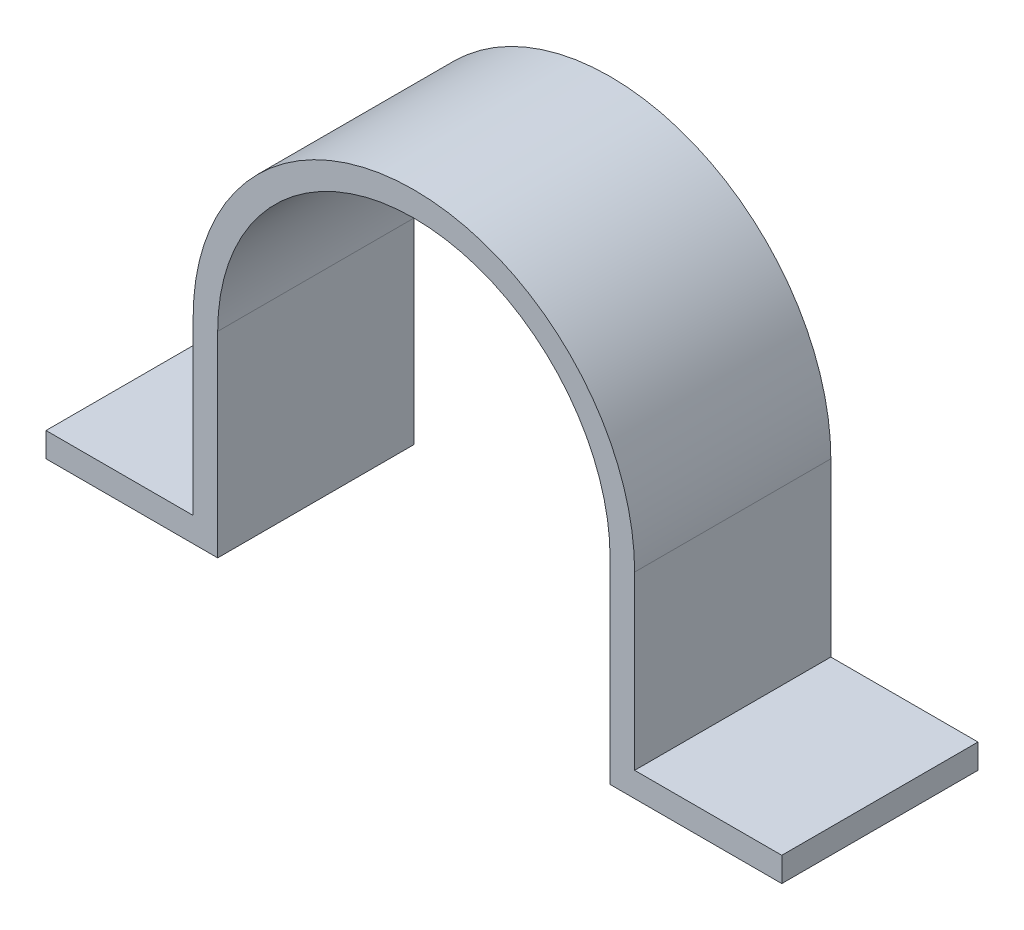
ISO-10303-21;
HEADER;
FILE_DESCRIPTION(('STEP AP214'),'2;1');
FILE_NAME('part.step','',(''),(''),'','','');
FILE_SCHEMA(('AUTOMOTIVE_DESIGN { 1 0 10303 214 1 1 1 1 }'));
ENDSEC;
DATA;
#1=APPLICATION_CONTEXT('core data for automotive mechanical design processes');
#2=APPLICATION_PROTOCOL_DEFINITION('international standard','automotive_design',2000,#1);
#3=PRODUCT_CONTEXT('',#1,'mechanical');
#4=PRODUCT('Part','Part','',(#3));
#5=PRODUCT_RELATED_PRODUCT_CATEGORY('part','',(#4));
#6=PRODUCT_DEFINITION_FORMATION('','',#4);
#7=PRODUCT_DEFINITION_CONTEXT('part definition',#1,'design');
#8=PRODUCT_DEFINITION('design','',#6,#7);
#9=PRODUCT_DEFINITION_SHAPE('','',#8);
#10=(LENGTH_UNIT() NAMED_UNIT(*) SI_UNIT(.MILLI.,.METRE.));
#11=(NAMED_UNIT(*) PLANE_ANGLE_UNIT() SI_UNIT($,.RADIAN.));
#12=(NAMED_UNIT(*) SI_UNIT($,.STERADIAN.) SOLID_ANGLE_UNIT());
#13=UNCERTAINTY_MEASURE_WITH_UNIT(LENGTH_MEASURE(1.E-05),#10,'distance_accuracy_value','');
#14=(GEOMETRIC_REPRESENTATION_CONTEXT(3) GLOBAL_UNCERTAINTY_ASSIGNED_CONTEXT((#13)) GLOBAL_UNIT_ASSIGNED_CONTEXT((#10,
#11,#12)) REPRESENTATION_CONTEXT('',''));
#15=CARTESIAN_POINT('',(0.,0.,0.));
#16=DIRECTION('',(0.,0.,1.));
#17=DIRECTION('',(1.,0.,0.));
#18=AXIS2_PLACEMENT_3D('',#15,#16,#17);
#19=CARTESIAN_POINT('',(-47.625,-25.4,0.));
#20=DIRECTION('',(0.,-1.,0.));
#21=DIRECTION('',(0.,0.,-1.));
#22=AXIS2_PLACEMENT_3D('',#19,#20,#21);
#23=PLANE('',#22);
#24=DIRECTION('',(1.,0.,0.));
#25=VECTOR('',#24,1.);
#26=CARTESIAN_POINT('',(0.,-25.4,25.4));
#27=LINE('',#26,#25);
#28=CARTESIAN_POINT('',(-47.625,-25.4,25.4));
#29=VERTEX_POINT('',#28);
#30=CARTESIAN_POINT('',(-25.4,-25.4,25.4));
#31=VERTEX_POINT('',#30);
#32=EDGE_CURVE('E79',#29,#31,#27,.T.);
#33=ORIENTED_EDGE('',*,*,#32,.F.);
#34=DIRECTION('',(0.,0.,1.));
#35=VECTOR('',#34,1.);
#36=CARTESIAN_POINT('',(-47.625,-25.4,0.));
#37=LINE('',#36,#35);
#38=CARTESIAN_POINT('',(-47.625,-25.4,0.));
#39=VERTEX_POINT('',#38);
#40=EDGE_CURVE('E218',#39,#29,#37,.T.);
#41=ORIENTED_EDGE('',*,*,#40,.F.);
#42=DIRECTION('',(1.,0.,0.));
#43=VECTOR('',#42,1.);
#44=CARTESIAN_POINT('',(0.,-25.4,0.));
#45=LINE('',#44,#43);
#46=CARTESIAN_POINT('',(-25.4,-25.4,0.));
#47=VERTEX_POINT('',#46);
#48=EDGE_CURVE('E136',#39,#47,#45,.T.);
#49=ORIENTED_EDGE('',*,*,#48,.T.);
#50=DIRECTION('',(0.,0.,1.));
#51=VECTOR('',#50,1.);
#52=CARTESIAN_POINT('',(-25.4,-25.4,0.));
#53=LINE('',#52,#51);
#54=EDGE_CURVE('E68',#31,#47,#53,.F.);
#55=ORIENTED_EDGE('',*,*,#54,.F.);
#56=EDGE_LOOP('',(#33,#41,#49,#55));
#57=FACE_BOUND('',#56,.T.);
#58=ADVANCED_FACE('F17',(#57),#23,.T.);
#59=CARTESIAN_POINT('',(-25.4,-25.4,0.));
#60=DIRECTION('',(1.,0.,0.));
#61=DIRECTION('',(0.,1.,0.));
#62=AXIS2_PLACEMENT_3D('',#59,#60,#61);
#63=PLANE('',#62);
#64=DIRECTION('',(0.,1.,0.));
#65=VECTOR('',#64,1.);
#66=CARTESIAN_POINT('',(-25.4,-3.44837810483188,25.4));
#67=LINE('',#66,#65);
#68=CARTESIAN_POINT('',(-25.4,0.,25.4));
#69=VERTEX_POINT('',#68);
#70=EDGE_CURVE('E151',#31,#69,#67,.T.);
#71=ORIENTED_EDGE('',*,*,#70,.F.);
#72=ORIENTED_EDGE('',*,*,#54,.T.);
#73=DIRECTION('',(0.,1.,0.));
#74=VECTOR('',#73,1.);
#75=CARTESIAN_POINT('',(-25.4,-3.44837810483188,0.));
#76=LINE('',#75,#74);
#77=CARTESIAN_POINT('',(-25.4,0.,0.));
#78=VERTEX_POINT('',#77);
#79=EDGE_CURVE('E61',#47,#78,#76,.T.);
#80=ORIENTED_EDGE('',*,*,#79,.T.);
#81=DIRECTION('',(0.,0.,1.));
#82=VECTOR('',#81,1.);
#83=CARTESIAN_POINT('',(-25.4,0.,0.));
#84=LINE('',#83,#82);
#85=EDGE_CURVE('E227',#78,#69,#84,.T.);
#86=ORIENTED_EDGE('',*,*,#85,.T.);
#87=EDGE_LOOP('',(#71,#72,#80,#86));
#88=FACE_BOUND('',#87,.T.);
#89=ADVANCED_FACE('F258',(#88),#63,.T.);
#90=CARTESIAN_POINT('',(0.,0.,0.));
#91=DIRECTION('',(0.,0.,1.));
#92=DIRECTION('',(1.,0.,0.));
#93=AXIS2_PLACEMENT_3D('',#90,#91,#92);
#94=CYLINDRICAL_SURFACE('',#93,25.4);
#95=DIRECTION('',(0.,0.,1.));
#96=VECTOR('',#95,1.);
#97=CARTESIAN_POINT('',(25.4,0.,0.));
#98=LINE('',#97,#96);
#99=CARTESIAN_POINT('',(25.4,0.,25.4));
#100=VERTEX_POINT('',#99);
#101=CARTESIAN_POINT('',(25.4,0.,0.));
#102=VERTEX_POINT('',#101);
#103=EDGE_CURVE('E108',#100,#102,#98,.F.);
#104=ORIENTED_EDGE('',*,*,#103,.F.);
#105=CARTESIAN_POINT('',(0.,0.,25.4));
#106=DIRECTION('',(0.,0.,1.));
#107=DIRECTION('',(1.,0.,0.));
#108=AXIS2_PLACEMENT_3D('',#105,#106,#107);
#109=CIRCLE('',#108,25.4);
#110=EDGE_CURVE('E148',#69,#100,#109,.F.);
#111=ORIENTED_EDGE('',*,*,#110,.F.);
#112=ORIENTED_EDGE('',*,*,#85,.F.);
#113=CARTESIAN_POINT('',(0.,0.,0.));
#114=DIRECTION('',(0.,0.,1.));
#115=DIRECTION('',(1.,0.,0.));
#116=AXIS2_PLACEMENT_3D('',#113,#114,#115);
#117=CIRCLE('',#116,25.4);
#118=EDGE_CURVE('E20',#78,#102,#117,.F.);
#119=ORIENTED_EDGE('',*,*,#118,.T.);
#120=EDGE_LOOP('',(#104,#111,#112,#119));
#121=FACE_BOUND('',#120,.T.);
#122=ADVANCED_FACE('F263',(#121),#94,.F.);
#123=CARTESIAN_POINT('',(25.4,0.,0.));
#124=DIRECTION('',(-1.,0.,0.));
#125=DIRECTION('',(0.,0.,1.));
#126=AXIS2_PLACEMENT_3D('',#123,#124,#125);
#127=PLANE('',#126);
#128=DIRECTION('',(0.,1.,0.));
#129=VECTOR('',#128,1.);
#130=CARTESIAN_POINT('',(25.4,-3.44837810483188,25.4));
#131=LINE('',#130,#129);
#132=CARTESIAN_POINT('',(25.4,-25.4,25.4));
#133=VERTEX_POINT('',#132);
#134=EDGE_CURVE('E150',#100,#133,#131,.F.);
#135=ORIENTED_EDGE('',*,*,#134,.F.);
#136=ORIENTED_EDGE('',*,*,#103,.T.);
#137=DIRECTION('',(0.,1.,0.));
#138=VECTOR('',#137,1.);
#139=CARTESIAN_POINT('',(25.4,-3.44837810483188,0.));
#140=LINE('',#139,#138);
#141=CARTESIAN_POINT('',(25.4,-25.4,0.));
#142=VERTEX_POINT('',#141);
#143=EDGE_CURVE('E102',#102,#142,#140,.F.);
#144=ORIENTED_EDGE('',*,*,#143,.T.);
#145=DIRECTION('',(0.,0.,-1.));
#146=VECTOR('',#145,1.);
#147=CARTESIAN_POINT('',(25.4,-25.4,0.));
#148=LINE('',#147,#146);
#149=EDGE_CURVE('E106',#133,#142,#148,.T.);
#150=ORIENTED_EDGE('',*,*,#149,.F.);
#151=EDGE_LOOP('',(#135,#136,#144,#150));
#152=FACE_BOUND('',#151,.T.);
#153=ADVANCED_FACE('F105',(#152),#127,.T.);
#154=CARTESIAN_POINT('',(25.4,-25.4,0.));
#155=DIRECTION('',(0.,-1.,0.));
#156=DIRECTION('',(0.,0.,-1.));
#157=AXIS2_PLACEMENT_3D('',#154,#155,#156);
#158=PLANE('',#157);
#159=DIRECTION('',(1.,0.,0.));
#160=VECTOR('',#159,1.);
#161=CARTESIAN_POINT('',(0.,-25.4,25.4));
#162=LINE('',#161,#160);
#163=CARTESIAN_POINT('',(47.625,-25.4,25.4));
#164=VERTEX_POINT('',#163);
#165=EDGE_CURVE('E118',#133,#164,#162,.T.);
#166=ORIENTED_EDGE('',*,*,#165,.F.);
#167=ORIENTED_EDGE('',*,*,#149,.T.);
#168=DIRECTION('',(1.,0.,0.));
#169=VECTOR('',#168,1.);
#170=CARTESIAN_POINT('',(0.,-25.4,0.));
#171=LINE('',#170,#169);
#172=CARTESIAN_POINT('',(47.625,-25.4,0.));
#173=VERTEX_POINT('',#172);
#174=EDGE_CURVE('E112',#142,#173,#171,.T.);
#175=ORIENTED_EDGE('',*,*,#174,.T.);
#176=DIRECTION('',(0.,0.,-1.));
#177=VECTOR('',#176,1.);
#178=CARTESIAN_POINT('',(47.625,-25.4,0.));
#179=LINE('',#178,#177);
#180=EDGE_CURVE('E120',#164,#173,#179,.T.);
#181=ORIENTED_EDGE('',*,*,#180,.F.);
#182=EDGE_LOOP('',(#166,#167,#175,#181));
#183=FACE_BOUND('',#182,.T.);
#184=ADVANCED_FACE('F115',(#183),#158,.T.);
#185=CARTESIAN_POINT('',(47.625,-25.4,0.));
#186=DIRECTION('',(1.,0.,0.));
#187=DIRECTION('',(0.,0.,-1.));
#188=AXIS2_PLACEMENT_3D('',#185,#186,#187);
#189=PLANE('',#188);
#190=DIRECTION('',(0.,1.,0.));
#191=VECTOR('',#190,1.);
#192=CARTESIAN_POINT('',(47.625,-3.44837810483188,25.4));
#193=LINE('',#192,#191);
#194=CARTESIAN_POINT('',(47.625,-22.225,25.4));
#195=VERTEX_POINT('',#194);
#196=EDGE_CURVE('E187',#164,#195,#193,.T.);
#197=ORIENTED_EDGE('',*,*,#196,.F.);
#198=ORIENTED_EDGE('',*,*,#180,.T.);
#199=DIRECTION('',(0.,1.,0.));
#200=VECTOR('',#199,1.);
#201=CARTESIAN_POINT('',(47.625,-3.44837810483188,0.));
#202=LINE('',#201,#200);
#203=CARTESIAN_POINT('',(47.625,-22.225,0.));
#204=VERTEX_POINT('',#203);
#205=EDGE_CURVE('E127',#173,#204,#202,.T.);
#206=ORIENTED_EDGE('',*,*,#205,.T.);
#207=DIRECTION('',(0.,0.,1.));
#208=VECTOR('',#207,1.);
#209=CARTESIAN_POINT('',(47.625,-22.225,0.));
#210=LINE('',#209,#208);
#211=EDGE_CURVE('E176',#195,#204,#210,.F.);
#212=ORIENTED_EDGE('',*,*,#211,.F.);
#213=EDGE_LOOP('',(#197,#198,#206,#212));
#214=FACE_BOUND('',#213,.T.);
#215=ADVANCED_FACE('F293',(#214),#189,.T.);
#216=CARTESIAN_POINT('',(-28.575,-22.225,0.));
#217=DIRECTION('',(0.,1.,0.));
#218=DIRECTION('',(-1.,0.,0.));
#219=AXIS2_PLACEMENT_3D('',#216,#217,#218);
#220=PLANE('',#219);
#221=DIRECTION('',(1.,0.,0.));
#222=VECTOR('',#221,1.);
#223=CARTESIAN_POINT('',(0.,-22.225,25.4));
#224=LINE('',#223,#222);
#225=CARTESIAN_POINT('',(-28.575,-22.225,25.4));
#226=VERTEX_POINT('',#225);
#227=CARTESIAN_POINT('',(-47.625,-22.225,25.4));
#228=VERTEX_POINT('',#227);
#229=EDGE_CURVE('E203',#226,#228,#224,.F.);
#230=ORIENTED_EDGE('',*,*,#229,.F.);
#231=DIRECTION('',(0.,0.,1.));
#232=VECTOR('',#231,1.);
#233=CARTESIAN_POINT('',(-28.575,-22.225,0.));
#234=LINE('',#233,#232);
#235=CARTESIAN_POINT('',(-28.575,-22.225,0.));
#236=VERTEX_POINT('',#235);
#237=EDGE_CURVE('E156',#236,#226,#234,.T.);
#238=ORIENTED_EDGE('',*,*,#237,.F.);
#239=DIRECTION('',(1.,0.,0.));
#240=VECTOR('',#239,1.);
#241=CARTESIAN_POINT('',(0.,-22.225,0.));
#242=LINE('',#241,#240);
#243=CARTESIAN_POINT('',(-47.625,-22.225,0.));
#244=VERTEX_POINT('',#243);
#245=EDGE_CURVE('E196',#236,#244,#242,.F.);
#246=ORIENTED_EDGE('',*,*,#245,.T.);
#247=DIRECTION('',(0.,0.,1.));
#248=VECTOR('',#247,1.);
#249=CARTESIAN_POINT('',(-47.625,-22.225,0.));
#250=LINE('',#249,#248);
#251=EDGE_CURVE('E210',#228,#244,#250,.F.);
#252=ORIENTED_EDGE('',*,*,#251,.F.);
#253=EDGE_LOOP('',(#230,#238,#246,#252));
#254=FACE_BOUND('',#253,.T.);
#255=ADVANCED_FACE('F290',(#254),#220,.T.);
#256=CARTESIAN_POINT('',(-47.625,-22.225,0.));
#257=DIRECTION('',(-1.,0.,0.));
#258=DIRECTION('',(0.,0.,1.));
#259=AXIS2_PLACEMENT_3D('',#256,#257,#258);
#260=PLANE('',#259);
#261=DIRECTION('',(0.,1.,0.));
#262=VECTOR('',#261,1.);
#263=CARTESIAN_POINT('',(-47.625,-3.44837810483188,25.4));
#264=LINE('',#263,#262);
#265=EDGE_CURVE('E181',#228,#29,#264,.F.);
#266=ORIENTED_EDGE('',*,*,#265,.F.);
#267=ORIENTED_EDGE('',*,*,#251,.T.);
#268=DIRECTION('',(0.,1.,0.));
#269=VECTOR('',#268,1.);
#270=CARTESIAN_POINT('',(-47.625,-3.44837810483188,0.));
#271=LINE('',#270,#269);
#272=EDGE_CURVE('E139',#244,#39,#271,.F.);
#273=ORIENTED_EDGE('',*,*,#272,.T.);
#274=ORIENTED_EDGE('',*,*,#40,.T.);
#275=EDGE_LOOP('',(#266,#267,#273,#274));
#276=FACE_BOUND('',#275,.T.);
#277=ADVANCED_FACE('F255',(#276),#260,.T.);
#278=CARTESIAN_POINT('',(47.625,-22.225,0.));
#279=DIRECTION('',(0.,1.,0.));
#280=DIRECTION('',(0.,0.,1.));
#281=AXIS2_PLACEMENT_3D('',#278,#279,#280);
#282=PLANE('',#281);
#283=DIRECTION('',(1.,0.,0.));
#284=VECTOR('',#283,1.);
#285=CARTESIAN_POINT('',(0.,-22.225,25.4));
#286=LINE('',#285,#284);
#287=CARTESIAN_POINT('',(28.575,-22.225,25.4));
#288=VERTEX_POINT('',#287);
#289=EDGE_CURVE('E184',#195,#288,#286,.F.);
#290=ORIENTED_EDGE('',*,*,#289,.F.);
#291=ORIENTED_EDGE('',*,*,#211,.T.);
#292=DIRECTION('',(1.,0.,0.));
#293=VECTOR('',#292,1.);
#294=CARTESIAN_POINT('',(0.,-22.225,0.));
#295=LINE('',#294,#293);
#296=CARTESIAN_POINT('',(28.575,-22.225,0.));
#297=VERTEX_POINT('',#296);
#298=EDGE_CURVE('E129',#204,#297,#295,.F.);
#299=ORIENTED_EDGE('',*,*,#298,.T.);
#300=DIRECTION('',(0.,0.,-1.));
#301=VECTOR('',#300,1.);
#302=CARTESIAN_POINT('',(28.575,-22.225,0.));
#303=LINE('',#302,#301);
#304=EDGE_CURVE('E147',#288,#297,#303,.T.);
#305=ORIENTED_EDGE('',*,*,#304,.F.);
#306=EDGE_LOOP('',(#290,#291,#299,#305));
#307=FACE_BOUND('',#306,.T.);
#308=ADVANCED_FACE('F284',(#307),#282,.T.);
#309=CARTESIAN_POINT('',(0.,-3.44837810483188,0.));
#310=DIRECTION('',(0.,0.,1.));
#311=DIRECTION('',(1.,0.,0.));
#312=AXIS2_PLACEMENT_3D('',#309,#310,#311);
#313=PLANE('',#312);
#314=ORIENTED_EDGE('',*,*,#272,.F.);
#315=ORIENTED_EDGE('',*,*,#245,.F.);
#316=DIRECTION('',(0.,-1.,0.));
#317=VECTOR('',#316,1.);
#318=CARTESIAN_POINT('',(-28.575,0.,0.));
#319=LINE('',#318,#317);
#320=CARTESIAN_POINT('',(-28.575,0.,0.));
#321=VERTEX_POINT('',#320);
#322=EDGE_CURVE('E138',#321,#236,#319,.T.);
#323=ORIENTED_EDGE('',*,*,#322,.F.);
#324=CARTESIAN_POINT('',(0.,0.,0.));
#325=DIRECTION('',(0.,0.,1.));
#326=DIRECTION('',(1.,0.,0.));
#327=AXIS2_PLACEMENT_3D('',#324,#325,#326);
#328=CIRCLE('',#327,28.575);
#329=CARTESIAN_POINT('',(28.575,0.,0.));
#330=VERTEX_POINT('',#329);
#331=EDGE_CURVE('E145',#330,#321,#328,.T.);
#332=ORIENTED_EDGE('',*,*,#331,.F.);
#333=DIRECTION('',(0.,1.,0.));
#334=VECTOR('',#333,1.);
#335=CARTESIAN_POINT('',(28.575,-22.225,0.));
#336=LINE('',#335,#334);
#337=EDGE_CURVE('E166',#297,#330,#336,.T.);
#338=ORIENTED_EDGE('',*,*,#337,.F.);
#339=ORIENTED_EDGE('',*,*,#298,.F.);
#340=ORIENTED_EDGE('',*,*,#205,.F.);
#341=ORIENTED_EDGE('',*,*,#174,.F.);
#342=ORIENTED_EDGE('',*,*,#143,.F.);
#343=ORIENTED_EDGE('',*,*,#118,.F.);
#344=ORIENTED_EDGE('',*,*,#79,.F.);
#345=ORIENTED_EDGE('',*,*,#48,.F.);
#346=EDGE_LOOP('',(#314,#315,#323,#332,#338,#339,#340,#341,#342,#343,#344,#345));
#347=FACE_BOUND('',#346,.T.);
#348=ADVANCED_FACE('F124',(#347),#313,.F.);
#349=CARTESIAN_POINT('',(-28.575,0.,0.));
#350=DIRECTION('',(-1.,0.,0.));
#351=DIRECTION('',(0.,-1.,0.));
#352=AXIS2_PLACEMENT_3D('',#349,#350,#351);
#353=PLANE('',#352);
#354=DIRECTION('',(0.,1.,0.));
#355=VECTOR('',#354,1.);
#356=CARTESIAN_POINT('',(-28.575,-3.44837810483188,25.4));
#357=LINE('',#356,#355);
#358=CARTESIAN_POINT('',(-28.575,0.,25.4));
#359=VERTEX_POINT('',#358);
#360=EDGE_CURVE('E186',#359,#226,#357,.F.);
#361=ORIENTED_EDGE('',*,*,#360,.F.);
#362=DIRECTION('',(0.,0.,1.));
#363=VECTOR('',#362,1.);
#364=CARTESIAN_POINT('',(-28.575,0.,0.));
#365=LINE('',#364,#363);
#366=EDGE_CURVE('E144',#321,#359,#365,.T.);
#367=ORIENTED_EDGE('',*,*,#366,.F.);
#368=ORIENTED_EDGE('',*,*,#322,.T.);
#369=ORIENTED_EDGE('',*,*,#237,.T.);
#370=EDGE_LOOP('',(#361,#367,#368,#369));
#371=FACE_BOUND('',#370,.T.);
#372=ADVANCED_FACE('F278',(#371),#353,.T.);
#373=CARTESIAN_POINT('',(0.,-3.44837810483188,25.4));
#374=DIRECTION('',(0.,0.,1.));
#375=DIRECTION('',(1.,0.,0.));
#376=AXIS2_PLACEMENT_3D('',#373,#374,#375);
#377=PLANE('',#376);
#378=ORIENTED_EDGE('',*,*,#229,.T.);
#379=ORIENTED_EDGE('',*,*,#265,.T.);
#380=ORIENTED_EDGE('',*,*,#32,.T.);
#381=ORIENTED_EDGE('',*,*,#70,.T.);
#382=ORIENTED_EDGE('',*,*,#110,.T.);
#383=ORIENTED_EDGE('',*,*,#134,.T.);
#384=ORIENTED_EDGE('',*,*,#165,.T.);
#385=ORIENTED_EDGE('',*,*,#196,.T.);
#386=ORIENTED_EDGE('',*,*,#289,.T.);
#387=DIRECTION('',(0.,1.,0.));
#388=VECTOR('',#387,1.);
#389=CARTESIAN_POINT('',(28.575,-22.225,25.4));
#390=LINE('',#389,#388);
#391=CARTESIAN_POINT('',(28.575,0.,25.4));
#392=VERTEX_POINT('',#391);
#393=EDGE_CURVE('E35',#392,#288,#390,.F.);
#394=ORIENTED_EDGE('',*,*,#393,.F.);
#395=CARTESIAN_POINT('',(0.,0.,25.4));
#396=DIRECTION('',(0.,0.,1.));
#397=DIRECTION('',(1.,0.,0.));
#398=AXIS2_PLACEMENT_3D('',#395,#396,#397);
#399=CIRCLE('',#398,28.575);
#400=EDGE_CURVE('E26',#359,#392,#399,.F.);
#401=ORIENTED_EDGE('',*,*,#400,.F.);
#402=ORIENTED_EDGE('',*,*,#360,.T.);
#403=EDGE_LOOP('',(#378,#379,#380,#381,#382,#383,#384,#385,#386,#394,#401,#402));
#404=FACE_BOUND('',#403,.T.);
#405=ADVANCED_FACE('F272',(#404),#377,.T.);
#406=CARTESIAN_POINT('',(28.575,-22.225,0.));
#407=DIRECTION('',(1.,0.,0.));
#408=DIRECTION('',(0.,0.,-1.));
#409=AXIS2_PLACEMENT_3D('',#406,#407,#408);
#410=PLANE('',#409);
#411=ORIENTED_EDGE('',*,*,#393,.T.);
#412=ORIENTED_EDGE('',*,*,#304,.T.);
#413=ORIENTED_EDGE('',*,*,#337,.T.);
#414=DIRECTION('',(0.,0.,1.));
#415=VECTOR('',#414,1.);
#416=CARTESIAN_POINT('',(28.575,0.,0.));
#417=LINE('',#416,#415);
#418=EDGE_CURVE('E11',#392,#330,#417,.F.);
#419=ORIENTED_EDGE('',*,*,#418,.F.);
#420=EDGE_LOOP('',(#411,#412,#413,#419));
#421=FACE_BOUND('',#420,.T.);
#422=ADVANCED_FACE('F266',(#421),#410,.T.);
#423=CARTESIAN_POINT('',(0.,0.,0.));
#424=DIRECTION('',(0.,0.,1.));
#425=DIRECTION('',(1.,0.,0.));
#426=AXIS2_PLACEMENT_3D('',#423,#424,#425);
#427=CYLINDRICAL_SURFACE('',#426,28.575);
#428=ORIENTED_EDGE('',*,*,#400,.T.);
#429=ORIENTED_EDGE('',*,*,#418,.T.);
#430=ORIENTED_EDGE('',*,*,#331,.T.);
#431=ORIENTED_EDGE('',*,*,#366,.T.);
#432=EDGE_LOOP('',(#428,#429,#430,#431));
#433=FACE_BOUND('',#432,.T.);
#434=ADVANCED_FACE('F264',(#433),#427,.T.);
#435=CLOSED_SHELL('',(#58,#89,#122,#153,#184,#215,#255,#277,#308,#348,#372,#405,#422,#434));
#436=MANIFOLD_SOLID_BREP('B1',#435);
#437=ADVANCED_BREP_SHAPE_REPRESENTATION('',(#18,#436),#14);
#438=SHAPE_DEFINITION_REPRESENTATION(#9,#437);
ENDSEC;
END-ISO-10303-21;
